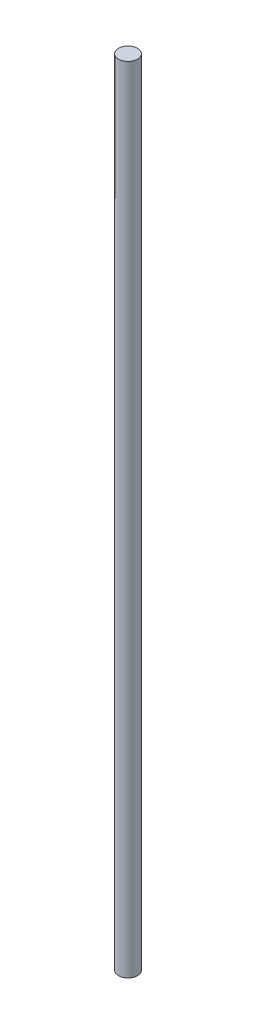
ISO-10303-21;
HEADER;
FILE_DESCRIPTION(('STEP AP214'),'2;1');
FILE_NAME('part.step','',(''),(''),'','','');
FILE_SCHEMA(('AUTOMOTIVE_DESIGN { 1 0 10303 214 1 1 1 1 }'));
ENDSEC;
DATA;
#1=APPLICATION_CONTEXT('core data for automotive mechanical design processes');
#2=APPLICATION_PROTOCOL_DEFINITION('international standard','automotive_design',2000,#1);
#3=PRODUCT_CONTEXT('',#1,'mechanical');
#4=PRODUCT('Part','Part','',(#3));
#5=PRODUCT_RELATED_PRODUCT_CATEGORY('part','',(#4));
#6=PRODUCT_DEFINITION_FORMATION('','',#4);
#7=PRODUCT_DEFINITION_CONTEXT('part definition',#1,'design');
#8=PRODUCT_DEFINITION('design','',#6,#7);
#9=PRODUCT_DEFINITION_SHAPE('','',#8);
#10=(LENGTH_UNIT() NAMED_UNIT(*) SI_UNIT(.MILLI.,.METRE.));
#11=(NAMED_UNIT(*) PLANE_ANGLE_UNIT() SI_UNIT($,.RADIAN.));
#12=(NAMED_UNIT(*) SI_UNIT($,.STERADIAN.) SOLID_ANGLE_UNIT());
#13=UNCERTAINTY_MEASURE_WITH_UNIT(LENGTH_MEASURE(1.E-05),#10,'distance_accuracy_value','');
#14=(GEOMETRIC_REPRESENTATION_CONTEXT(3) GLOBAL_UNCERTAINTY_ASSIGNED_CONTEXT((#13)) GLOBAL_UNIT_ASSIGNED_CONTEXT((#10,
#11,#12)) REPRESENTATION_CONTEXT('',''));
#15=CARTESIAN_POINT('',(0.,0.,0.));
#16=DIRECTION('',(0.,0.,1.));
#17=DIRECTION('',(1.,0.,0.));
#18=AXIS2_PLACEMENT_3D('',#15,#16,#17);
#19=CARTESIAN_POINT('',(0.,214.,0.));
#20=DIRECTION('',(0.,-1.,0.));
#21=DIRECTION('',(0.,0.,-1.));
#22=AXIS2_PLACEMENT_3D('',#19,#20,#21);
#23=CYLINDRICAL_SURFACE('',#22,2.555);
#24=CARTESIAN_POINT('',(0.,214.,0.));
#25=DIRECTION('',(0.,1.,0.));
#26=DIRECTION('',(0.,0.,1.));
#27=AXIS2_PLACEMENT_3D('',#24,#25,#26);
#28=CIRCLE('',#27,2.555);
#29=CARTESIAN_POINT('',(0.,214.,2.555));
#30=VERTEX_POINT('',#29);
#31=EDGE_CURVE('E10',#30,#30,#28,.T.);
#32=ORIENTED_EDGE('',*,*,#31,.F.);
#33=EDGE_LOOP('',(#32));
#34=FACE_BOUND('',#33,.T.);
#35=CARTESIAN_POINT('',(0.,0.,0.));
#36=DIRECTION('',(0.,1.,0.));
#37=DIRECTION('',(0.,0.,1.));
#38=AXIS2_PLACEMENT_3D('',#35,#36,#37);
#39=CIRCLE('',#38,2.555);
#40=CARTESIAN_POINT('',(0.,0.,2.555));
#41=VERTEX_POINT('',#40);
#42=EDGE_CURVE('E38',#41,#41,#39,.T.);
#43=ORIENTED_EDGE('',*,*,#42,.T.);
#44=EDGE_LOOP('',(#43));
#45=FACE_BOUND('',#44,.T.);
#46=ADVANCED_FACE('F35',(#34,#45),#23,.T.);
#47=CARTESIAN_POINT('',(0.,214.,0.));
#48=DIRECTION('',(0.,1.,0.));
#49=DIRECTION('',(0.,0.,1.));
#50=AXIS2_PLACEMENT_3D('',#47,#48,#49);
#51=PLANE('',#50);
#52=ORIENTED_EDGE('',*,*,#31,.T.);
#53=EDGE_LOOP('',(#52));
#54=FACE_BOUND('',#53,.T.);
#55=ADVANCED_FACE('F50',(#54),#51,.T.);
#56=CARTESIAN_POINT('',(0.,0.,0.));
#57=DIRECTION('',(0.,1.,0.));
#58=DIRECTION('',(0.,0.,1.));
#59=AXIS2_PLACEMENT_3D('',#56,#57,#58);
#60=PLANE('',#59);
#61=ORIENTED_EDGE('',*,*,#42,.F.);
#62=EDGE_LOOP('',(#61));
#63=FACE_BOUND('',#62,.T.);
#64=ADVANCED_FACE('F48',(#63),#60,.F.);
#65=CLOSED_SHELL('',(#46,#55,#64));
#66=MANIFOLD_SOLID_BREP('B2',#65);
#67=ADVANCED_BREP_SHAPE_REPRESENTATION('',(#18,#66),#14);
#68=SHAPE_DEFINITION_REPRESENTATION(#9,#67);
ENDSEC;
END-ISO-10303-21;
